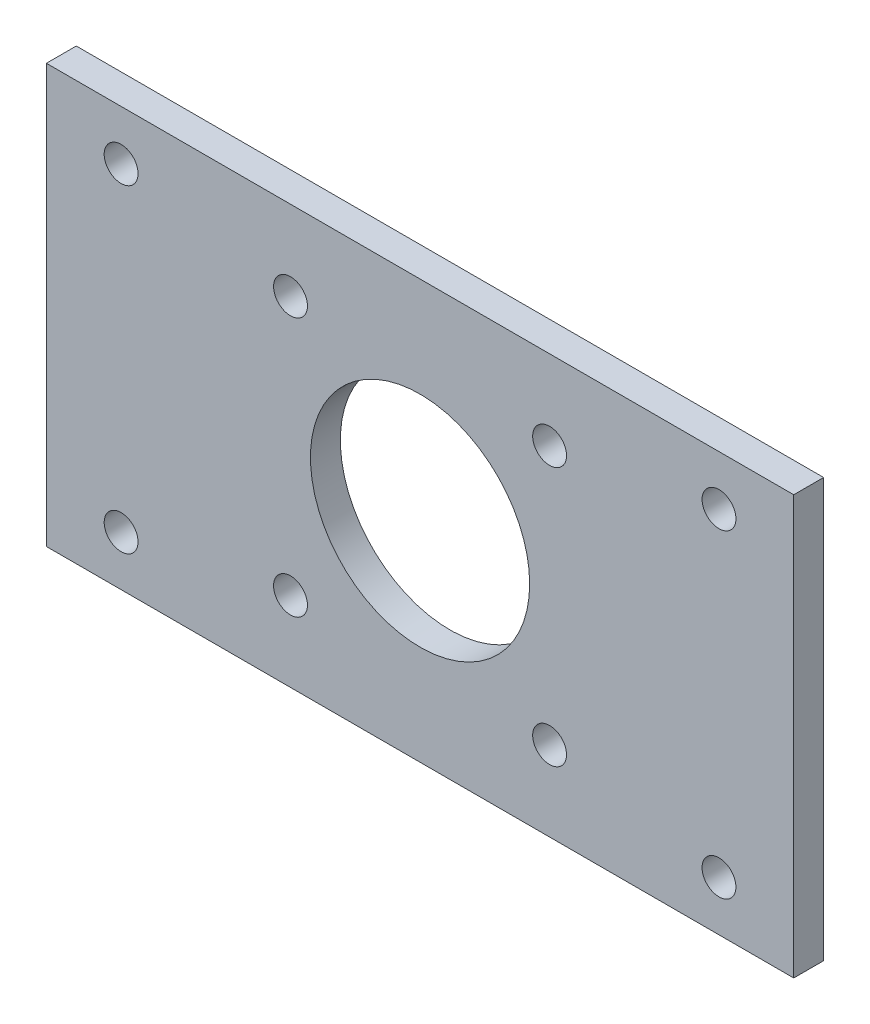
ISO-10303-21;
HEADER;
FILE_DESCRIPTION(('STEP AP214'),'2;1');
FILE_NAME('part.step','',(''),(''),'','','');
FILE_SCHEMA(('AUTOMOTIVE_DESIGN { 1 0 10303 214 1 1 1 1 }'));
ENDSEC;
DATA;
#1=APPLICATION_CONTEXT('core data for automotive mechanical design processes');
#2=APPLICATION_PROTOCOL_DEFINITION('international standard','automotive_design',2000,#1);
#3=PRODUCT_CONTEXT('',#1,'mechanical');
#4=PRODUCT('Part','Part','',(#3));
#5=PRODUCT_RELATED_PRODUCT_CATEGORY('part','',(#4));
#6=PRODUCT_DEFINITION_FORMATION('','',#4);
#7=PRODUCT_DEFINITION_CONTEXT('part definition',#1,'design');
#8=PRODUCT_DEFINITION('design','',#6,#7);
#9=PRODUCT_DEFINITION_SHAPE('','',#8);
#10=(LENGTH_UNIT() NAMED_UNIT(*) SI_UNIT(.MILLI.,.METRE.));
#11=(NAMED_UNIT(*) PLANE_ANGLE_UNIT() SI_UNIT($,.RADIAN.));
#12=(NAMED_UNIT(*) SI_UNIT($,.STERADIAN.) SOLID_ANGLE_UNIT());
#13=UNCERTAINTY_MEASURE_WITH_UNIT(LENGTH_MEASURE(1.E-05),#10,'distance_accuracy_value','');
#14=(GEOMETRIC_REPRESENTATION_CONTEXT(3) GLOBAL_UNCERTAINTY_ASSIGNED_CONTEXT((#13)) GLOBAL_UNIT_ASSIGNED_CONTEXT((#10,
#11,#12)) REPRESENTATION_CONTEXT('',''));
#15=CARTESIAN_POINT('',(0.,0.,0.));
#16=DIRECTION('',(0.,0.,1.));
#17=DIRECTION('',(1.,0.,0.));
#18=AXIS2_PLACEMENT_3D('',#15,#16,#17);
#19=CARTESIAN_POINT('',(-37.5,-21.,3.));
#20=DIRECTION('',(1.,0.,0.));
#21=DIRECTION('',(0.,0.,-1.));
#22=AXIS2_PLACEMENT_3D('',#19,#20,#21);
#23=PLANE('',#22);
#24=DIRECTION('',(0.,-1.,0.));
#25=VECTOR('',#24,1.);
#26=CARTESIAN_POINT('',(-37.5,-21.,0.));
#27=LINE('',#26,#25);
#28=CARTESIAN_POINT('',(-37.5,21.,0.));
#29=VERTEX_POINT('',#28);
#30=CARTESIAN_POINT('',(-37.5,-21.,0.));
#31=VERTEX_POINT('',#30);
#32=EDGE_CURVE('E96',#29,#31,#27,.T.);
#33=ORIENTED_EDGE('',*,*,#32,.T.);
#34=DIRECTION('',(0.,0.,-1.));
#35=VECTOR('',#34,1.);
#36=CARTESIAN_POINT('',(-37.5,-21.,3.));
#37=LINE('',#36,#35);
#38=CARTESIAN_POINT('',(-37.5,-21.,3.));
#39=VERTEX_POINT('',#38);
#40=EDGE_CURVE('E11',#39,#31,#37,.T.);
#41=ORIENTED_EDGE('',*,*,#40,.F.);
#42=DIRECTION('',(0.,-1.,0.));
#43=VECTOR('',#42,1.);
#44=CARTESIAN_POINT('',(-37.5,-21.,3.));
#45=LINE('',#44,#43);
#46=CARTESIAN_POINT('',(-37.5,21.,3.));
#47=VERTEX_POINT('',#46);
#48=EDGE_CURVE('E84',#47,#39,#45,.T.);
#49=ORIENTED_EDGE('',*,*,#48,.F.);
#50=DIRECTION('',(0.,0.,-1.));
#51=VECTOR('',#50,1.);
#52=CARTESIAN_POINT('',(-37.5,21.,3.));
#53=LINE('',#52,#51);
#54=EDGE_CURVE('E92',#47,#29,#53,.T.);
#55=ORIENTED_EDGE('',*,*,#54,.T.);
#56=EDGE_LOOP('',(#33,#41,#49,#55));
#57=FACE_BOUND('',#56,.T.);
#58=ADVANCED_FACE('F33',(#57),#23,.F.);
#59=CARTESIAN_POINT('',(-37.5,-21.,3.));
#60=DIRECTION('',(0.,1.,0.));
#61=DIRECTION('',(0.,0.,1.));
#62=AXIS2_PLACEMENT_3D('',#59,#60,#61);
#63=PLANE('',#62);
#64=DIRECTION('',(1.,0.,0.));
#65=VECTOR('',#64,1.);
#66=CARTESIAN_POINT('',(-37.5,-21.,0.));
#67=LINE('',#66,#65);
#68=CARTESIAN_POINT('',(37.5,-21.,0.));
#69=VERTEX_POINT('',#68);
#70=EDGE_CURVE('E88',#31,#69,#67,.T.);
#71=ORIENTED_EDGE('',*,*,#70,.T.);
#72=DIRECTION('',(0.,0.,-1.));
#73=VECTOR('',#72,1.);
#74=CARTESIAN_POINT('',(37.5,-21.,3.));
#75=LINE('',#74,#73);
#76=CARTESIAN_POINT('',(37.5,-21.,3.));
#77=VERTEX_POINT('',#76);
#78=EDGE_CURVE('E41',#77,#69,#75,.T.);
#79=ORIENTED_EDGE('',*,*,#78,.F.);
#80=DIRECTION('',(1.,0.,0.));
#81=VECTOR('',#80,1.);
#82=CARTESIAN_POINT('',(-37.5,-21.,3.));
#83=LINE('',#82,#81);
#84=EDGE_CURVE('E79',#39,#77,#83,.T.);
#85=ORIENTED_EDGE('',*,*,#84,.F.);
#86=ORIENTED_EDGE('',*,*,#40,.T.);
#87=EDGE_LOOP('',(#71,#79,#85,#86));
#88=FACE_BOUND('',#87,.T.);
#89=ADVANCED_FACE('F87',(#88),#63,.F.);
#90=CARTESIAN_POINT('',(37.5,-21.,3.));
#91=DIRECTION('',(-1.,0.,0.));
#92=DIRECTION('',(0.,0.,1.));
#93=AXIS2_PLACEMENT_3D('',#90,#91,#92);
#94=PLANE('',#93);
#95=DIRECTION('',(0.,1.,0.));
#96=VECTOR('',#95,1.);
#97=CARTESIAN_POINT('',(37.5,-21.,0.));
#98=LINE('',#97,#96);
#99=CARTESIAN_POINT('',(37.5,21.,0.));
#100=VERTEX_POINT('',#99);
#101=EDGE_CURVE('E66',#69,#100,#98,.T.);
#102=ORIENTED_EDGE('',*,*,#101,.T.);
#103=DIRECTION('',(0.,0.,-1.));
#104=VECTOR('',#103,1.);
#105=CARTESIAN_POINT('',(37.5,21.,3.));
#106=LINE('',#105,#104);
#107=CARTESIAN_POINT('',(37.5,21.,3.));
#108=VERTEX_POINT('',#107);
#109=EDGE_CURVE('E89',#108,#100,#106,.T.);
#110=ORIENTED_EDGE('',*,*,#109,.F.);
#111=DIRECTION('',(0.,1.,0.));
#112=VECTOR('',#111,1.);
#113=CARTESIAN_POINT('',(37.5,-21.,3.));
#114=LINE('',#113,#112);
#115=EDGE_CURVE('E82',#77,#108,#114,.T.);
#116=ORIENTED_EDGE('',*,*,#115,.F.);
#117=ORIENTED_EDGE('',*,*,#78,.T.);
#118=EDGE_LOOP('',(#102,#110,#116,#117));
#119=FACE_BOUND('',#118,.T.);
#120=ADVANCED_FACE('F90',(#119),#94,.F.);
#121=CARTESIAN_POINT('',(-37.5,21.,3.));
#122=DIRECTION('',(0.,-1.,0.));
#123=DIRECTION('',(0.,0.,-1.));
#124=AXIS2_PLACEMENT_3D('',#121,#122,#123);
#125=PLANE('',#124);
#126=DIRECTION('',(-1.,0.,0.));
#127=VECTOR('',#126,1.);
#128=CARTESIAN_POINT('',(-37.5,21.,0.));
#129=LINE('',#128,#127);
#130=EDGE_CURVE('E72',#100,#29,#129,.T.);
#131=ORIENTED_EDGE('',*,*,#130,.T.);
#132=ORIENTED_EDGE('',*,*,#54,.F.);
#133=DIRECTION('',(-1.,0.,0.));
#134=VECTOR('',#133,1.);
#135=CARTESIAN_POINT('',(-37.5,21.,3.));
#136=LINE('',#135,#134);
#137=EDGE_CURVE('E49',#108,#47,#136,.T.);
#138=ORIENTED_EDGE('',*,*,#137,.F.);
#139=ORIENTED_EDGE('',*,*,#109,.T.);
#140=EDGE_LOOP('',(#131,#132,#138,#139));
#141=FACE_BOUND('',#140,.T.);
#142=ADVANCED_FACE('F104',(#141),#125,.F.);
#143=CARTESIAN_POINT('',(0.,0.,3.));
#144=DIRECTION('',(0.,0.,-1.));
#145=DIRECTION('',(-1.,0.,0.));
#146=AXIS2_PLACEMENT_3D('',#143,#144,#145);
#147=PLANE('',#146);
#148=CARTESIAN_POINT('',(-30.,-16.,3.));
#149=DIRECTION('',(0.,0.,1.));
#150=DIRECTION('',(1.,0.,0.));
#151=AXIS2_PLACEMENT_3D('',#148,#149,#150);
#152=CIRCLE('',#151,1.69999999999999);
#153=CARTESIAN_POINT('',(-28.3,-16.,3.));
#154=VERTEX_POINT('',#153);
#155=EDGE_CURVE('E160',#154,#154,#152,.T.);
#156=ORIENTED_EDGE('',*,*,#155,.F.);
#157=EDGE_LOOP('',(#156));
#158=FACE_BOUND('',#157,.T.);
#159=CARTESIAN_POINT('',(-30.,16.,3.));
#160=DIRECTION('',(0.,0.,1.));
#161=DIRECTION('',(1.,0.,0.));
#162=AXIS2_PLACEMENT_3D('',#159,#160,#161);
#163=CIRCLE('',#162,1.69999999999999);
#164=CARTESIAN_POINT('',(-28.3,16.,3.));
#165=VERTEX_POINT('',#164);
#166=EDGE_CURVE('E154',#165,#165,#163,.T.);
#167=ORIENTED_EDGE('',*,*,#166,.F.);
#168=EDGE_LOOP('',(#167));
#169=FACE_BOUND('',#168,.T.);
#170=CARTESIAN_POINT('',(30.,-16.,3.));
#171=DIRECTION('',(0.,0.,1.));
#172=DIRECTION('',(1.,0.,0.));
#173=AXIS2_PLACEMENT_3D('',#170,#171,#172);
#174=CIRCLE('',#173,1.69999999999999);
#175=CARTESIAN_POINT('',(31.7,-16.,3.));
#176=VERTEX_POINT('',#175);
#177=EDGE_CURVE('E148',#176,#176,#174,.T.);
#178=ORIENTED_EDGE('',*,*,#177,.F.);
#179=EDGE_LOOP('',(#178));
#180=FACE_BOUND('',#179,.T.);
#181=CARTESIAN_POINT('',(30.,16.,3.));
#182=DIRECTION('',(0.,0.,1.));
#183=DIRECTION('',(1.,0.,0.));
#184=AXIS2_PLACEMENT_3D('',#181,#182,#183);
#185=CIRCLE('',#184,1.69999999999999);
#186=CARTESIAN_POINT('',(31.7,16.,3.));
#187=VERTEX_POINT('',#186);
#188=EDGE_CURVE('E142',#187,#187,#185,.T.);
#189=ORIENTED_EDGE('',*,*,#188,.F.);
#190=EDGE_LOOP('',(#189));
#191=FACE_BOUND('',#190,.T.);
#192=CARTESIAN_POINT('',(-13.,-13.,3.));
#193=DIRECTION('',(0.,0.,1.));
#194=DIRECTION('',(1.,0.,0.));
#195=AXIS2_PLACEMENT_3D('',#192,#193,#194);
#196=CIRCLE('',#195,1.69999999999999);
#197=CARTESIAN_POINT('',(-11.3,-13.,3.));
#198=VERTEX_POINT('',#197);
#199=EDGE_CURVE('E136',#198,#198,#196,.T.);
#200=ORIENTED_EDGE('',*,*,#199,.F.);
#201=EDGE_LOOP('',(#200));
#202=FACE_BOUND('',#201,.T.);
#203=CARTESIAN_POINT('',(13.,-13.,3.));
#204=DIRECTION('',(0.,0.,1.));
#205=DIRECTION('',(1.,0.,0.));
#206=AXIS2_PLACEMENT_3D('',#203,#204,#205);
#207=CIRCLE('',#206,1.69999999999999);
#208=CARTESIAN_POINT('',(14.7,-13.,3.));
#209=VERTEX_POINT('',#208);
#210=EDGE_CURVE('E130',#209,#209,#207,.T.);
#211=ORIENTED_EDGE('',*,*,#210,.F.);
#212=EDGE_LOOP('',(#211));
#213=FACE_BOUND('',#212,.T.);
#214=CARTESIAN_POINT('',(13.,13.,3.));
#215=DIRECTION('',(0.,0.,1.));
#216=DIRECTION('',(1.,0.,0.));
#217=AXIS2_PLACEMENT_3D('',#214,#215,#216);
#218=CIRCLE('',#217,1.69999999999999);
#219=CARTESIAN_POINT('',(14.7,13.,3.));
#220=VERTEX_POINT('',#219);
#221=EDGE_CURVE('E124',#220,#220,#218,.T.);
#222=ORIENTED_EDGE('',*,*,#221,.F.);
#223=EDGE_LOOP('',(#222));
#224=FACE_BOUND('',#223,.T.);
#225=CARTESIAN_POINT('',(-13.,13.,3.));
#226=DIRECTION('',(0.,0.,1.));
#227=DIRECTION('',(1.,0.,0.));
#228=AXIS2_PLACEMENT_3D('',#225,#226,#227);
#229=CIRCLE('',#228,1.69999999999999);
#230=CARTESIAN_POINT('',(-11.3,13.,3.));
#231=VERTEX_POINT('',#230);
#232=EDGE_CURVE('E118',#231,#231,#229,.T.);
#233=ORIENTED_EDGE('',*,*,#232,.F.);
#234=EDGE_LOOP('',(#233));
#235=FACE_BOUND('',#234,.T.);
#236=CARTESIAN_POINT('',(0.,0.,3.));
#237=DIRECTION('',(0.,0.,1.));
#238=DIRECTION('',(1.,0.,0.));
#239=AXIS2_PLACEMENT_3D('',#236,#237,#238);
#240=CIRCLE('',#239,11.);
#241=CARTESIAN_POINT('',(11.,0.,3.));
#242=VERTEX_POINT('',#241);
#243=EDGE_CURVE('E110',#242,#242,#240,.T.);
#244=ORIENTED_EDGE('',*,*,#243,.F.);
#245=EDGE_LOOP('',(#244));
#246=FACE_BOUND('',#245,.T.);
#247=ORIENTED_EDGE('',*,*,#48,.T.);
#248=ORIENTED_EDGE('',*,*,#84,.T.);
#249=ORIENTED_EDGE('',*,*,#115,.T.);
#250=ORIENTED_EDGE('',*,*,#137,.T.);
#251=EDGE_LOOP('',(#247,#248,#249,#250));
#252=FACE_BOUND('',#251,.T.);
#253=ADVANCED_FACE('F80',(#158,#169,#180,#191,#202,#213,#224,#235,#246,#252),#147,.F.);
#254=CARTESIAN_POINT('',(0.,0.,0.));
#255=DIRECTION('',(0.,0.,-1.));
#256=DIRECTION('',(-1.,0.,0.));
#257=AXIS2_PLACEMENT_3D('',#254,#255,#256);
#258=PLANE('',#257);
#259=CARTESIAN_POINT('',(-30.,-16.,0.));
#260=DIRECTION('',(0.,0.,1.));
#261=DIRECTION('',(1.,0.,0.));
#262=AXIS2_PLACEMENT_3D('',#259,#260,#261);
#263=CIRCLE('',#262,1.69999999999999);
#264=CARTESIAN_POINT('',(-28.3,-16.,0.));
#265=VERTEX_POINT('',#264);
#266=EDGE_CURVE('E157',#265,#265,#263,.T.);
#267=ORIENTED_EDGE('',*,*,#266,.T.);
#268=EDGE_LOOP('',(#267));
#269=FACE_BOUND('',#268,.T.);
#270=CARTESIAN_POINT('',(-30.,16.,0.));
#271=DIRECTION('',(0.,0.,1.));
#272=DIRECTION('',(1.,0.,0.));
#273=AXIS2_PLACEMENT_3D('',#270,#271,#272);
#274=CIRCLE('',#273,1.69999999999999);
#275=CARTESIAN_POINT('',(-28.3,16.,0.));
#276=VERTEX_POINT('',#275);
#277=EDGE_CURVE('E151',#276,#276,#274,.T.);
#278=ORIENTED_EDGE('',*,*,#277,.T.);
#279=EDGE_LOOP('',(#278));
#280=FACE_BOUND('',#279,.T.);
#281=CARTESIAN_POINT('',(30.,-16.,0.));
#282=DIRECTION('',(0.,0.,1.));
#283=DIRECTION('',(1.,0.,0.));
#284=AXIS2_PLACEMENT_3D('',#281,#282,#283);
#285=CIRCLE('',#284,1.69999999999999);
#286=CARTESIAN_POINT('',(31.7,-16.,0.));
#287=VERTEX_POINT('',#286);
#288=EDGE_CURVE('E145',#287,#287,#285,.T.);
#289=ORIENTED_EDGE('',*,*,#288,.T.);
#290=EDGE_LOOP('',(#289));
#291=FACE_BOUND('',#290,.T.);
#292=CARTESIAN_POINT('',(30.,16.,0.));
#293=DIRECTION('',(0.,0.,1.));
#294=DIRECTION('',(1.,0.,0.));
#295=AXIS2_PLACEMENT_3D('',#292,#293,#294);
#296=CIRCLE('',#295,1.69999999999999);
#297=CARTESIAN_POINT('',(31.7,16.,0.));
#298=VERTEX_POINT('',#297);
#299=EDGE_CURVE('E139',#298,#298,#296,.T.);
#300=ORIENTED_EDGE('',*,*,#299,.T.);
#301=EDGE_LOOP('',(#300));
#302=FACE_BOUND('',#301,.T.);
#303=CARTESIAN_POINT('',(-13.,-13.,0.));
#304=DIRECTION('',(0.,0.,1.));
#305=DIRECTION('',(1.,0.,0.));
#306=AXIS2_PLACEMENT_3D('',#303,#304,#305);
#307=CIRCLE('',#306,1.69999999999999);
#308=CARTESIAN_POINT('',(-11.3,-13.,0.));
#309=VERTEX_POINT('',#308);
#310=EDGE_CURVE('E133',#309,#309,#307,.T.);
#311=ORIENTED_EDGE('',*,*,#310,.T.);
#312=EDGE_LOOP('',(#311));
#313=FACE_BOUND('',#312,.T.);
#314=CARTESIAN_POINT('',(13.,-13.,0.));
#315=DIRECTION('',(0.,0.,1.));
#316=DIRECTION('',(1.,0.,0.));
#317=AXIS2_PLACEMENT_3D('',#314,#315,#316);
#318=CIRCLE('',#317,1.69999999999999);
#319=CARTESIAN_POINT('',(14.7,-13.,0.));
#320=VERTEX_POINT('',#319);
#321=EDGE_CURVE('E127',#320,#320,#318,.T.);
#322=ORIENTED_EDGE('',*,*,#321,.T.);
#323=EDGE_LOOP('',(#322));
#324=FACE_BOUND('',#323,.T.);
#325=CARTESIAN_POINT('',(13.,13.,0.));
#326=DIRECTION('',(0.,0.,1.));
#327=DIRECTION('',(1.,0.,0.));
#328=AXIS2_PLACEMENT_3D('',#325,#326,#327);
#329=CIRCLE('',#328,1.69999999999999);
#330=CARTESIAN_POINT('',(14.7,13.,0.));
#331=VERTEX_POINT('',#330);
#332=EDGE_CURVE('E121',#331,#331,#329,.T.);
#333=ORIENTED_EDGE('',*,*,#332,.T.);
#334=EDGE_LOOP('',(#333));
#335=FACE_BOUND('',#334,.T.);
#336=CARTESIAN_POINT('',(-13.,13.,0.));
#337=DIRECTION('',(0.,0.,1.));
#338=DIRECTION('',(1.,0.,0.));
#339=AXIS2_PLACEMENT_3D('',#336,#337,#338);
#340=CIRCLE('',#339,1.69999999999999);
#341=CARTESIAN_POINT('',(-11.3,13.,0.));
#342=VERTEX_POINT('',#341);
#343=EDGE_CURVE('E113',#342,#342,#340,.T.);
#344=ORIENTED_EDGE('',*,*,#343,.T.);
#345=EDGE_LOOP('',(#344));
#346=FACE_BOUND('',#345,.T.);
#347=CARTESIAN_POINT('',(0.,0.,0.));
#348=DIRECTION('',(0.,0.,1.));
#349=DIRECTION('',(1.,0.,0.));
#350=AXIS2_PLACEMENT_3D('',#347,#348,#349);
#351=CIRCLE('',#350,11.);
#352=CARTESIAN_POINT('',(11.,0.,0.));
#353=VERTEX_POINT('',#352);
#354=EDGE_CURVE('E99',#353,#353,#351,.T.);
#355=ORIENTED_EDGE('',*,*,#354,.T.);
#356=EDGE_LOOP('',(#355));
#357=FACE_BOUND('',#356,.T.);
#358=ORIENTED_EDGE('',*,*,#32,.F.);
#359=ORIENTED_EDGE('',*,*,#130,.F.);
#360=ORIENTED_EDGE('',*,*,#101,.F.);
#361=ORIENTED_EDGE('',*,*,#70,.F.);
#362=EDGE_LOOP('',(#358,#359,#360,#361));
#363=FACE_BOUND('',#362,.T.);
#364=ADVANCED_FACE('F107',(#269,#280,#291,#302,#313,#324,#335,#346,#357,#363),#258,.T.);
#365=CARTESIAN_POINT('',(0.,0.,0.));
#366=DIRECTION('',(0.,0.,1.));
#367=DIRECTION('',(1.,0.,0.));
#368=AXIS2_PLACEMENT_3D('',#365,#366,#367);
#369=CYLINDRICAL_SURFACE('',#368,11.);
#370=ORIENTED_EDGE('',*,*,#354,.F.);
#371=EDGE_LOOP('',(#370));
#372=FACE_BOUND('',#371,.T.);
#373=ORIENTED_EDGE('',*,*,#243,.T.);
#374=EDGE_LOOP('',(#373));
#375=FACE_BOUND('',#374,.T.);
#376=ADVANCED_FACE('F185',(#372,#375),#369,.F.);
#377=CARTESIAN_POINT('',(-13.,13.,3.));
#378=DIRECTION('',(0.,0.,1.));
#379=DIRECTION('',(1.,0.,0.));
#380=AXIS2_PLACEMENT_3D('',#377,#378,#379);
#381=CYLINDRICAL_SURFACE('',#380,1.69999999999999);
#382=ORIENTED_EDGE('',*,*,#343,.F.);
#383=EDGE_LOOP('',(#382));
#384=FACE_BOUND('',#383,.T.);
#385=ORIENTED_EDGE('',*,*,#232,.T.);
#386=EDGE_LOOP('',(#385));
#387=FACE_BOUND('',#386,.T.);
#388=ADVANCED_FACE('F187',(#384,#387),#381,.F.);
#389=CARTESIAN_POINT('',(13.,13.,3.));
#390=DIRECTION('',(0.,0.,1.));
#391=DIRECTION('',(1.,0.,0.));
#392=AXIS2_PLACEMENT_3D('',#389,#390,#391);
#393=CYLINDRICAL_SURFACE('',#392,1.69999999999999);
#394=ORIENTED_EDGE('',*,*,#332,.F.);
#395=EDGE_LOOP('',(#394));
#396=FACE_BOUND('',#395,.T.);
#397=ORIENTED_EDGE('',*,*,#221,.T.);
#398=EDGE_LOOP('',(#397));
#399=FACE_BOUND('',#398,.T.);
#400=ADVANCED_FACE('F194',(#396,#399),#393,.F.);
#401=CARTESIAN_POINT('',(13.,-13.,3.));
#402=DIRECTION('',(0.,0.,1.));
#403=DIRECTION('',(1.,0.,0.));
#404=AXIS2_PLACEMENT_3D('',#401,#402,#403);
#405=CYLINDRICAL_SURFACE('',#404,1.69999999999999);
#406=ORIENTED_EDGE('',*,*,#321,.F.);
#407=EDGE_LOOP('',(#406));
#408=FACE_BOUND('',#407,.T.);
#409=ORIENTED_EDGE('',*,*,#210,.T.);
#410=EDGE_LOOP('',(#409));
#411=FACE_BOUND('',#410,.T.);
#412=ADVANCED_FACE('F273',(#408,#411),#405,.F.);
#413=CARTESIAN_POINT('',(-13.,-13.,3.));
#414=DIRECTION('',(0.,0.,1.));
#415=DIRECTION('',(1.,0.,0.));
#416=AXIS2_PLACEMENT_3D('',#413,#414,#415);
#417=CYLINDRICAL_SURFACE('',#416,1.69999999999999);
#418=ORIENTED_EDGE('',*,*,#310,.F.);
#419=EDGE_LOOP('',(#418));
#420=FACE_BOUND('',#419,.T.);
#421=ORIENTED_EDGE('',*,*,#199,.T.);
#422=EDGE_LOOP('',(#421));
#423=FACE_BOUND('',#422,.T.);
#424=ADVANCED_FACE('F235',(#420,#423),#417,.F.);
#425=CARTESIAN_POINT('',(30.,16.,3.));
#426=DIRECTION('',(0.,0.,1.));
#427=DIRECTION('',(1.,0.,0.));
#428=AXIS2_PLACEMENT_3D('',#425,#426,#427);
#429=CYLINDRICAL_SURFACE('',#428,1.69999999999999);
#430=ORIENTED_EDGE('',*,*,#299,.F.);
#431=EDGE_LOOP('',(#430));
#432=FACE_BOUND('',#431,.T.);
#433=ORIENTED_EDGE('',*,*,#188,.T.);
#434=EDGE_LOOP('',(#433));
#435=FACE_BOUND('',#434,.T.);
#436=ADVANCED_FACE('F229',(#432,#435),#429,.F.);
#437=CARTESIAN_POINT('',(30.,-16.,3.));
#438=DIRECTION('',(0.,0.,1.));
#439=DIRECTION('',(1.,0.,0.));
#440=AXIS2_PLACEMENT_3D('',#437,#438,#439);
#441=CYLINDRICAL_SURFACE('',#440,1.69999999999999);
#442=ORIENTED_EDGE('',*,*,#288,.F.);
#443=EDGE_LOOP('',(#442));
#444=FACE_BOUND('',#443,.T.);
#445=ORIENTED_EDGE('',*,*,#177,.T.);
#446=EDGE_LOOP('',(#445));
#447=FACE_BOUND('',#446,.T.);
#448=ADVANCED_FACE('F234',(#444,#447),#441,.F.);
#449=CARTESIAN_POINT('',(-30.,16.,3.));
#450=DIRECTION('',(0.,0.,1.));
#451=DIRECTION('',(1.,0.,0.));
#452=AXIS2_PLACEMENT_3D('',#449,#450,#451);
#453=CYLINDRICAL_SURFACE('',#452,1.69999999999999);
#454=ORIENTED_EDGE('',*,*,#277,.F.);
#455=EDGE_LOOP('',(#454));
#456=FACE_BOUND('',#455,.T.);
#457=ORIENTED_EDGE('',*,*,#166,.T.);
#458=EDGE_LOOP('',(#457));
#459=FACE_BOUND('',#458,.T.);
#460=ADVANCED_FACE('F247',(#456,#459),#453,.F.);
#461=CARTESIAN_POINT('',(-30.,-16.,3.));
#462=DIRECTION('',(0.,0.,1.));
#463=DIRECTION('',(1.,0.,0.));
#464=AXIS2_PLACEMENT_3D('',#461,#462,#463);
#465=CYLINDRICAL_SURFACE('',#464,1.69999999999999);
#466=ORIENTED_EDGE('',*,*,#266,.F.);
#467=EDGE_LOOP('',(#466));
#468=FACE_BOUND('',#467,.T.);
#469=ORIENTED_EDGE('',*,*,#155,.T.);
#470=EDGE_LOOP('',(#469));
#471=FACE_BOUND('',#470,.T.);
#472=ADVANCED_FACE('F164',(#468,#471),#465,.F.);
#473=CLOSED_SHELL('',(#58,#89,#120,#142,#253,#364,#376,#388,#400,#412,#424,#436,#448,#460,#472));
#474=MANIFOLD_SOLID_BREP('B2',#473);
#475=ADVANCED_BREP_SHAPE_REPRESENTATION('',(#18,#474),#14);
#476=SHAPE_DEFINITION_REPRESENTATION(#9,#475);
ENDSEC;
END-ISO-10303-21;
